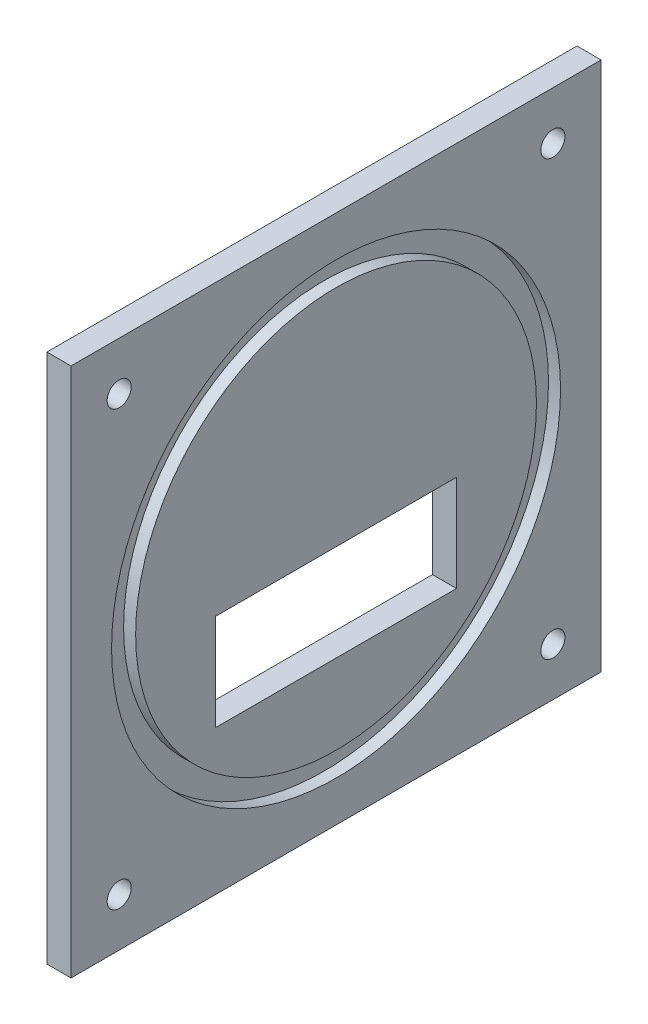
ISO-10303-21;
HEADER;
FILE_DESCRIPTION(('STEP AP214'),'2;1');
FILE_NAME('part.step','',(''),(''),'','','');
FILE_SCHEMA(('AUTOMOTIVE_DESIGN { 1 0 10303 214 1 1 1 1 }'));
ENDSEC;
DATA;
#1=APPLICATION_CONTEXT('core data for automotive mechanical design processes');
#2=APPLICATION_PROTOCOL_DEFINITION('international standard','automotive_design',2000,#1);
#3=PRODUCT_CONTEXT('',#1,'mechanical');
#4=PRODUCT('Part','Part','',(#3));
#5=PRODUCT_RELATED_PRODUCT_CATEGORY('part','',(#4));
#6=PRODUCT_DEFINITION_FORMATION('','',#4);
#7=PRODUCT_DEFINITION_CONTEXT('part definition',#1,'design');
#8=PRODUCT_DEFINITION('design','',#6,#7);
#9=PRODUCT_DEFINITION_SHAPE('','',#8);
#10=(LENGTH_UNIT() NAMED_UNIT(*) SI_UNIT(.MILLI.,.METRE.));
#11=(NAMED_UNIT(*) PLANE_ANGLE_UNIT() SI_UNIT($,.RADIAN.));
#12=(NAMED_UNIT(*) SI_UNIT($,.STERADIAN.) SOLID_ANGLE_UNIT());
#13=UNCERTAINTY_MEASURE_WITH_UNIT(LENGTH_MEASURE(1.E-05),#10,'distance_accuracy_value','');
#14=(GEOMETRIC_REPRESENTATION_CONTEXT(3) GLOBAL_UNCERTAINTY_ASSIGNED_CONTEXT((#13)) GLOBAL_UNIT_ASSIGNED_CONTEXT((#10,
#11,#12)) REPRESENTATION_CONTEXT('',''));
#15=CARTESIAN_POINT('',(0.,0.,0.));
#16=DIRECTION('',(0.,0.,1.));
#17=DIRECTION('',(1.,0.,0.));
#18=AXIS2_PLACEMENT_3D('',#15,#16,#17);
#19=CARTESIAN_POINT('',(10.,0.,0.));
#20=DIRECTION('',(-1.,0.,0.));
#21=DIRECTION('',(0.,0.,1.));
#22=AXIS2_PLACEMENT_3D('',#19,#20,#21);
#23=PLANE('',#22);
#24=DIRECTION('',(0.,-1.,0.));
#25=VECTOR('',#24,1.);
#26=CARTESIAN_POINT('',(10.,100.,-60.));
#27=LINE('',#26,#25);
#28=CARTESIAN_POINT('',(10.,100.,-60.));
#29=VERTEX_POINT('',#28);
#30=CARTESIAN_POINT('',(10.,60.,-60.));
#31=VERTEX_POINT('',#30);
#32=EDGE_CURVE('E97',#29,#31,#27,.T.);
#33=ORIENTED_EDGE('',*,*,#32,.F.);
#34=DIRECTION('',(0.,0.,1.));
#35=VECTOR('',#34,1.);
#36=CARTESIAN_POINT('',(10.,100.,-60.));
#37=LINE('',#36,#35);
#38=CARTESIAN_POINT('',(10.,100.,-160.));
#39=VERTEX_POINT('',#38);
#40=EDGE_CURVE('E120',#39,#29,#37,.T.);
#41=ORIENTED_EDGE('',*,*,#40,.F.);
#42=DIRECTION('',(0.,1.,0.));
#43=VECTOR('',#42,1.);
#44=CARTESIAN_POINT('',(10.,100.,-160.));
#45=LINE('',#44,#43);
#46=CARTESIAN_POINT('',(10.,60.,-160.));
#47=VERTEX_POINT('',#46);
#48=EDGE_CURVE('E118',#47,#39,#45,.T.);
#49=ORIENTED_EDGE('',*,*,#48,.F.);
#50=DIRECTION('',(0.,0.,-1.));
#51=VECTOR('',#50,1.);
#52=CARTESIAN_POINT('',(10.,60.,-60.));
#53=LINE('',#52,#51);
#54=EDGE_CURVE('E105',#31,#47,#53,.T.);
#55=ORIENTED_EDGE('',*,*,#54,.F.);
#56=EDGE_LOOP('',(#33,#41,#49,#55));
#57=FACE_BOUND('',#56,.T.);
#58=CARTESIAN_POINT('',(10.,110.,-110.));
#59=DIRECTION('',(1.,0.,0.));
#60=DIRECTION('',(0.,0.,-1.));
#61=AXIS2_PLACEMENT_3D('',#58,#59,#60);
#62=CIRCLE('',#61,83.17284);
#63=CARTESIAN_POINT('',(10.,110.,-193.17284));
#64=VERTEX_POINT('',#63);
#65=EDGE_CURVE('E271',#64,#64,#62,.T.);
#66=ORIENTED_EDGE('',*,*,#65,.T.);
#67=EDGE_LOOP('',(#66));
#68=FACE_BOUND('',#67,.T.);
#69=ADVANCED_FACE('F32',(#57,#68),#23,.F.);
#70=CARTESIAN_POINT('',(10.,20.,-20.));
#71=DIRECTION('',(1.,0.,0.));
#72=DIRECTION('',(0.,0.,-1.));
#73=AXIS2_PLACEMENT_3D('',#70,#71,#72);
#74=CIRCLE('',#73,5.);
#75=CARTESIAN_POINT('',(10.,20.,-25.));
#76=VERTEX_POINT('',#75);
#77=EDGE_CURVE('E251',#76,#76,#74,.T.);
#78=ORIENTED_EDGE('',*,*,#77,.F.);
#79=EDGE_LOOP('',(#78));
#80=FACE_BOUND('',#79,.T.);
#81=CARTESIAN_POINT('',(10.,20.,-200.));
#82=DIRECTION('',(1.,0.,0.));
#83=DIRECTION('',(0.,0.,-1.));
#84=AXIS2_PLACEMENT_3D('',#81,#82,#83);
#85=CIRCLE('',#84,4.99999999999999);
#86=CARTESIAN_POINT('',(10.,20.,-205.));
#87=VERTEX_POINT('',#86);
#88=EDGE_CURVE('E253',#87,#87,#85,.T.);
#89=ORIENTED_EDGE('',*,*,#88,.F.);
#90=EDGE_LOOP('',(#89));
#91=FACE_BOUND('',#90,.T.);
#92=CARTESIAN_POINT('',(10.,200.,-200.));
#93=DIRECTION('',(1.,0.,0.));
#94=DIRECTION('',(0.,0.,-1.));
#95=AXIS2_PLACEMENT_3D('',#92,#93,#94);
#96=CIRCLE('',#95,4.99999999999999);
#97=CARTESIAN_POINT('',(10.,200.,-205.));
#98=VERTEX_POINT('',#97);
#99=EDGE_CURVE('E259',#98,#98,#96,.T.);
#100=ORIENTED_EDGE('',*,*,#99,.F.);
#101=EDGE_LOOP('',(#100));
#102=FACE_BOUND('',#101,.T.);
#103=CARTESIAN_POINT('',(10.,200.,-20.));
#104=DIRECTION('',(1.,0.,0.));
#105=DIRECTION('',(0.,0.,-1.));
#106=AXIS2_PLACEMENT_3D('',#103,#104,#105);
#107=CIRCLE('',#106,5.00000000000001);
#108=CARTESIAN_POINT('',(10.,200.,-25.));
#109=VERTEX_POINT('',#108);
#110=EDGE_CURVE('E265',#109,#109,#107,.T.);
#111=ORIENTED_EDGE('',*,*,#110,.F.);
#112=EDGE_LOOP('',(#111));
#113=FACE_BOUND('',#112,.T.);
#114=CARTESIAN_POINT('',(10.,110.,-110.));
#115=DIRECTION('',(1.,0.,0.));
#116=DIRECTION('',(0.,0.,-1.));
#117=AXIS2_PLACEMENT_3D('',#114,#115,#116);
#118=CIRCLE('',#117,93.17284);
#119=CARTESIAN_POINT('',(10.,110.,-203.17284));
#120=VERTEX_POINT('',#119);
#121=EDGE_CURVE('E277',#120,#120,#118,.T.);
#122=ORIENTED_EDGE('',*,*,#121,.F.);
#123=EDGE_LOOP('',(#122));
#124=FACE_BOUND('',#123,.T.);
#125=DIRECTION('',(0.,-1.,0.));
#126=VECTOR('',#125,1.);
#127=CARTESIAN_POINT('',(10.,0.,0.));
#128=LINE('',#127,#126);
#129=CARTESIAN_POINT('',(10.,220.,0.));
#130=VERTEX_POINT('',#129);
#131=CARTESIAN_POINT('',(10.,0.,0.));
#132=VERTEX_POINT('',#131);
#133=EDGE_CURVE('E136',#130,#132,#128,.T.);
#134=ORIENTED_EDGE('',*,*,#133,.T.);
#135=DIRECTION('',(0.,0.,-1.));
#136=VECTOR('',#135,1.);
#137=CARTESIAN_POINT('',(10.,0.,0.));
#138=LINE('',#137,#136);
#139=CARTESIAN_POINT('',(10.,0.,-220.));
#140=VERTEX_POINT('',#139);
#141=EDGE_CURVE('E139',#132,#140,#138,.T.);
#142=ORIENTED_EDGE('',*,*,#141,.T.);
#143=DIRECTION('',(0.,1.,0.));
#144=VECTOR('',#143,1.);
#145=CARTESIAN_POINT('',(10.,0.,-220.));
#146=LINE('',#145,#144);
#147=CARTESIAN_POINT('',(10.,220.,-220.));
#148=VERTEX_POINT('',#147);
#149=EDGE_CURVE('E142',#140,#148,#146,.T.);
#150=ORIENTED_EDGE('',*,*,#149,.T.);
#151=DIRECTION('',(0.,0.,1.));
#152=VECTOR('',#151,1.);
#153=CARTESIAN_POINT('',(10.,220.,0.));
#154=LINE('',#153,#152);
#155=EDGE_CURVE('E144',#148,#130,#154,.T.);
#156=ORIENTED_EDGE('',*,*,#155,.T.);
#157=EDGE_LOOP('',(#134,#142,#150,#156));
#158=FACE_BOUND('',#157,.T.);
#159=ADVANCED_FACE('F179',(#80,#91,#102,#113,#124,#158),#23,.F.);
#160=CARTESIAN_POINT('',(0.,0.,0.));
#161=DIRECTION('',(-1.,0.,0.));
#162=DIRECTION('',(0.,0.,1.));
#163=AXIS2_PLACEMENT_3D('',#160,#161,#162);
#164=PLANE('',#163);
#165=CARTESIAN_POINT('',(0.,20.,-20.));
#166=DIRECTION('',(1.,0.,0.));
#167=DIRECTION('',(0.,0.,-1.));
#168=AXIS2_PLACEMENT_3D('',#165,#166,#167);
#169=CIRCLE('',#168,5.);
#170=CARTESIAN_POINT('',(0.,20.,-25.));
#171=VERTEX_POINT('',#170);
#172=EDGE_CURVE('E248',#171,#171,#169,.T.);
#173=ORIENTED_EDGE('',*,*,#172,.T.);
#174=EDGE_LOOP('',(#173));
#175=FACE_BOUND('',#174,.T.);
#176=CARTESIAN_POINT('',(0.,20.,-200.));
#177=DIRECTION('',(1.,0.,0.));
#178=DIRECTION('',(0.,0.,-1.));
#179=AXIS2_PLACEMENT_3D('',#176,#177,#178);
#180=CIRCLE('',#179,4.99999999999999);
#181=CARTESIAN_POINT('',(0.,20.,-205.));
#182=VERTEX_POINT('',#181);
#183=EDGE_CURVE('E256',#182,#182,#180,.T.);
#184=ORIENTED_EDGE('',*,*,#183,.T.);
#185=EDGE_LOOP('',(#184));
#186=FACE_BOUND('',#185,.T.);
#187=CARTESIAN_POINT('',(0.,200.,-200.));
#188=DIRECTION('',(1.,0.,0.));
#189=DIRECTION('',(0.,0.,-1.));
#190=AXIS2_PLACEMENT_3D('',#187,#188,#189);
#191=CIRCLE('',#190,4.99999999999999);
#192=CARTESIAN_POINT('',(0.,200.,-205.));
#193=VERTEX_POINT('',#192);
#194=EDGE_CURVE('E262',#193,#193,#191,.T.);
#195=ORIENTED_EDGE('',*,*,#194,.T.);
#196=EDGE_LOOP('',(#195));
#197=FACE_BOUND('',#196,.T.);
#198=CARTESIAN_POINT('',(0.,200.,-20.));
#199=DIRECTION('',(1.,0.,0.));
#200=DIRECTION('',(0.,0.,-1.));
#201=AXIS2_PLACEMENT_3D('',#198,#199,#200);
#202=CIRCLE('',#201,5.00000000000001);
#203=CARTESIAN_POINT('',(0.,200.,-25.));
#204=VERTEX_POINT('',#203);
#205=EDGE_CURVE('E268',#204,#204,#202,.T.);
#206=ORIENTED_EDGE('',*,*,#205,.T.);
#207=EDGE_LOOP('',(#206));
#208=FACE_BOUND('',#207,.T.);
#209=DIRECTION('',(0.,-1.,0.));
#210=VECTOR('',#209,1.);
#211=CARTESIAN_POINT('',(0.,0.,0.));
#212=LINE('',#211,#210);
#213=CARTESIAN_POINT('',(0.,220.,0.));
#214=VERTEX_POINT('',#213);
#215=CARTESIAN_POINT('',(0.,0.,0.));
#216=VERTEX_POINT('',#215);
#217=EDGE_CURVE('E113',#214,#216,#212,.T.);
#218=ORIENTED_EDGE('',*,*,#217,.F.);
#219=DIRECTION('',(0.,0.,1.));
#220=VECTOR('',#219,1.);
#221=CARTESIAN_POINT('',(0.,220.,0.));
#222=LINE('',#221,#220);
#223=CARTESIAN_POINT('',(0.,220.,-220.));
#224=VERTEX_POINT('',#223);
#225=EDGE_CURVE('E140',#224,#214,#222,.T.);
#226=ORIENTED_EDGE('',*,*,#225,.F.);
#227=DIRECTION('',(0.,1.,0.));
#228=VECTOR('',#227,1.);
#229=CARTESIAN_POINT('',(0.,0.,-220.));
#230=LINE('',#229,#228);
#231=CARTESIAN_POINT('',(0.,0.,-220.));
#232=VERTEX_POINT('',#231);
#233=EDGE_CURVE('E151',#232,#224,#230,.T.);
#234=ORIENTED_EDGE('',*,*,#233,.F.);
#235=DIRECTION('',(0.,0.,-1.));
#236=VECTOR('',#235,1.);
#237=CARTESIAN_POINT('',(0.,0.,0.));
#238=LINE('',#237,#236);
#239=EDGE_CURVE('E149',#216,#232,#238,.T.);
#240=ORIENTED_EDGE('',*,*,#239,.F.);
#241=EDGE_LOOP('',(#218,#226,#234,#240));
#242=FACE_BOUND('',#241,.T.);
#243=DIRECTION('',(0.,0.,1.));
#244=VECTOR('',#243,1.);
#245=CARTESIAN_POINT('',(0.,100.,-60.));
#246=LINE('',#245,#244);
#247=CARTESIAN_POINT('',(0.,100.,-160.));
#248=VERTEX_POINT('',#247);
#249=CARTESIAN_POINT('',(0.,100.,-60.));
#250=VERTEX_POINT('',#249);
#251=EDGE_CURVE('E106',#248,#250,#246,.T.);
#252=ORIENTED_EDGE('',*,*,#251,.T.);
#253=DIRECTION('',(0.,-1.,0.));
#254=VECTOR('',#253,1.);
#255=CARTESIAN_POINT('',(0.,100.,-60.));
#256=LINE('',#255,#254);
#257=CARTESIAN_POINT('',(0.,60.,-60.));
#258=VERTEX_POINT('',#257);
#259=EDGE_CURVE('E55',#250,#258,#256,.T.);
#260=ORIENTED_EDGE('',*,*,#259,.T.);
#261=DIRECTION('',(0.,0.,-1.));
#262=VECTOR('',#261,1.);
#263=CARTESIAN_POINT('',(0.,60.,-60.));
#264=LINE('',#263,#262);
#265=CARTESIAN_POINT('',(0.,60.,-160.));
#266=VERTEX_POINT('',#265);
#267=EDGE_CURVE('E112',#258,#266,#264,.T.);
#268=ORIENTED_EDGE('',*,*,#267,.T.);
#269=DIRECTION('',(0.,1.,0.));
#270=VECTOR('',#269,1.);
#271=CARTESIAN_POINT('',(0.,100.,-160.));
#272=LINE('',#271,#270);
#273=EDGE_CURVE('E128',#266,#248,#272,.T.);
#274=ORIENTED_EDGE('',*,*,#273,.T.);
#275=EDGE_LOOP('',(#252,#260,#268,#274));
#276=FACE_BOUND('',#275,.T.);
#277=ADVANCED_FACE('F169',(#175,#186,#197,#208,#242,#276),#164,.T.);
#278=CARTESIAN_POINT('',(10.,0.,0.));
#279=DIRECTION('',(0.,0.,-1.));
#280=DIRECTION('',(-1.,0.,0.));
#281=AXIS2_PLACEMENT_3D('',#278,#279,#280);
#282=PLANE('',#281);
#283=ORIENTED_EDGE('',*,*,#217,.T.);
#284=DIRECTION('',(-1.,0.,0.));
#285=VECTOR('',#284,1.);
#286=CARTESIAN_POINT('',(10.,0.,0.));
#287=LINE('',#286,#285);
#288=EDGE_CURVE('E11',#132,#216,#287,.T.);
#289=ORIENTED_EDGE('',*,*,#288,.F.);
#290=ORIENTED_EDGE('',*,*,#133,.F.);
#291=DIRECTION('',(-1.,0.,0.));
#292=VECTOR('',#291,1.);
#293=CARTESIAN_POINT('',(10.,220.,0.));
#294=LINE('',#293,#292);
#295=EDGE_CURVE('E146',#130,#214,#294,.T.);
#296=ORIENTED_EDGE('',*,*,#295,.T.);
#297=EDGE_LOOP('',(#283,#289,#290,#296));
#298=FACE_BOUND('',#297,.T.);
#299=ADVANCED_FACE('F34',(#298),#282,.F.);
#300=CARTESIAN_POINT('',(10.,0.,0.));
#301=DIRECTION('',(0.,1.,0.));
#302=DIRECTION('',(0.,0.,1.));
#303=AXIS2_PLACEMENT_3D('',#300,#301,#302);
#304=PLANE('',#303);
#305=ORIENTED_EDGE('',*,*,#239,.T.);
#306=DIRECTION('',(-1.,0.,0.));
#307=VECTOR('',#306,1.);
#308=CARTESIAN_POINT('',(10.,0.,-220.));
#309=LINE('',#308,#307);
#310=EDGE_CURVE('E40',#140,#232,#309,.T.);
#311=ORIENTED_EDGE('',*,*,#310,.F.);
#312=ORIENTED_EDGE('',*,*,#141,.F.);
#313=ORIENTED_EDGE('',*,*,#288,.T.);
#314=EDGE_LOOP('',(#305,#311,#312,#313));
#315=FACE_BOUND('',#314,.T.);
#316=ADVANCED_FACE('F180',(#315),#304,.F.);
#317=CARTESIAN_POINT('',(10.,0.,-220.));
#318=DIRECTION('',(0.,0.,1.));
#319=DIRECTION('',(1.,0.,0.));
#320=AXIS2_PLACEMENT_3D('',#317,#318,#319);
#321=PLANE('',#320);
#322=ORIENTED_EDGE('',*,*,#233,.T.);
#323=DIRECTION('',(-1.,0.,0.));
#324=VECTOR('',#323,1.);
#325=CARTESIAN_POINT('',(10.,220.,-220.));
#326=LINE('',#325,#324);
#327=EDGE_CURVE('E156',#148,#224,#326,.T.);
#328=ORIENTED_EDGE('',*,*,#327,.F.);
#329=ORIENTED_EDGE('',*,*,#149,.F.);
#330=ORIENTED_EDGE('',*,*,#310,.T.);
#331=EDGE_LOOP('',(#322,#328,#329,#330));
#332=FACE_BOUND('',#331,.T.);
#333=ADVANCED_FACE('F163',(#332),#321,.F.);
#334=CARTESIAN_POINT('',(10.,220.,0.));
#335=DIRECTION('',(0.,-1.,0.));
#336=DIRECTION('',(0.,0.,-1.));
#337=AXIS2_PLACEMENT_3D('',#334,#335,#336);
#338=PLANE('',#337);
#339=ORIENTED_EDGE('',*,*,#225,.T.);
#340=ORIENTED_EDGE('',*,*,#295,.F.);
#341=ORIENTED_EDGE('',*,*,#155,.F.);
#342=ORIENTED_EDGE('',*,*,#327,.T.);
#343=EDGE_LOOP('',(#339,#340,#341,#342));
#344=FACE_BOUND('',#343,.T.);
#345=ADVANCED_FACE('F173',(#344),#338,.F.);
#346=CARTESIAN_POINT('',(10.,100.,-60.));
#347=DIRECTION('',(0.,0.,-1.));
#348=DIRECTION('',(0.,1.,0.));
#349=AXIS2_PLACEMENT_3D('',#346,#347,#348);
#350=PLANE('',#349);
#351=ORIENTED_EDGE('',*,*,#259,.F.);
#352=DIRECTION('',(-1.,0.,0.));
#353=VECTOR('',#352,1.);
#354=CARTESIAN_POINT('',(10.,100.,-60.));
#355=LINE('',#354,#353);
#356=EDGE_CURVE('E101',#29,#250,#355,.T.);
#357=ORIENTED_EDGE('',*,*,#356,.F.);
#358=ORIENTED_EDGE('',*,*,#32,.T.);
#359=DIRECTION('',(-1.,0.,0.));
#360=VECTOR('',#359,1.);
#361=CARTESIAN_POINT('',(10.,60.,-60.));
#362=LINE('',#361,#360);
#363=EDGE_CURVE('E100',#31,#258,#362,.T.);
#364=ORIENTED_EDGE('',*,*,#363,.T.);
#365=EDGE_LOOP('',(#351,#357,#358,#364));
#366=FACE_BOUND('',#365,.T.);
#367=ADVANCED_FACE('F99',(#366),#350,.T.);
#368=CARTESIAN_POINT('',(10.,60.,-60.));
#369=DIRECTION('',(0.,1.,0.));
#370=DIRECTION('',(0.,0.,1.));
#371=AXIS2_PLACEMENT_3D('',#368,#369,#370);
#372=PLANE('',#371);
#373=ORIENTED_EDGE('',*,*,#267,.F.);
#374=ORIENTED_EDGE('',*,*,#363,.F.);
#375=ORIENTED_EDGE('',*,*,#54,.T.);
#376=DIRECTION('',(-1.,0.,0.));
#377=VECTOR('',#376,1.);
#378=CARTESIAN_POINT('',(10.,60.,-160.));
#379=LINE('',#378,#377);
#380=EDGE_CURVE('E114',#47,#266,#379,.T.);
#381=ORIENTED_EDGE('',*,*,#380,.T.);
#382=EDGE_LOOP('',(#373,#374,#375,#381));
#383=FACE_BOUND('',#382,.T.);
#384=ADVANCED_FACE('F109',(#383),#372,.T.);
#385=CARTESIAN_POINT('',(10.,100.,-160.));
#386=DIRECTION('',(0.,0.,1.));
#387=DIRECTION('',(0.,-1.,0.));
#388=AXIS2_PLACEMENT_3D('',#385,#386,#387);
#389=PLANE('',#388);
#390=ORIENTED_EDGE('',*,*,#273,.F.);
#391=ORIENTED_EDGE('',*,*,#380,.F.);
#392=ORIENTED_EDGE('',*,*,#48,.T.);
#393=DIRECTION('',(-1.,0.,0.));
#394=VECTOR('',#393,1.);
#395=CARTESIAN_POINT('',(10.,100.,-160.));
#396=LINE('',#395,#394);
#397=EDGE_CURVE('E47',#39,#248,#396,.T.);
#398=ORIENTED_EDGE('',*,*,#397,.T.);
#399=EDGE_LOOP('',(#390,#391,#392,#398));
#400=FACE_BOUND('',#399,.T.);
#401=ADVANCED_FACE('F206',(#400),#389,.T.);
#402=CARTESIAN_POINT('',(10.,100.,-60.));
#403=DIRECTION('',(0.,-1.,0.));
#404=DIRECTION('',(0.,0.,-1.));
#405=AXIS2_PLACEMENT_3D('',#402,#403,#404);
#406=PLANE('',#405);
#407=ORIENTED_EDGE('',*,*,#251,.F.);
#408=ORIENTED_EDGE('',*,*,#397,.F.);
#409=ORIENTED_EDGE('',*,*,#40,.T.);
#410=ORIENTED_EDGE('',*,*,#356,.T.);
#411=EDGE_LOOP('',(#407,#408,#409,#410));
#412=FACE_BOUND('',#411,.T.);
#413=ADVANCED_FACE('F210',(#412),#406,.T.);
#414=CARTESIAN_POINT('',(5.,110.,-110.));
#415=DIRECTION('',(1.,0.,0.));
#416=DIRECTION('',(0.,0.,-1.));
#417=AXIS2_PLACEMENT_3D('',#414,#415,#416);
#418=CYLINDRICAL_SURFACE('',#417,93.17284);
#419=CARTESIAN_POINT('',(5.,110.,-110.));
#420=DIRECTION('',(1.,0.,0.));
#421=DIRECTION('',(0.,0.,-1.));
#422=AXIS2_PLACEMENT_3D('',#419,#420,#421);
#423=CIRCLE('',#422,93.17284);
#424=CARTESIAN_POINT('',(5.,110.,-203.17284));
#425=VERTEX_POINT('',#424);
#426=EDGE_CURVE('E126',#425,#425,#423,.T.);
#427=ORIENTED_EDGE('',*,*,#426,.F.);
#428=EDGE_LOOP('',(#427));
#429=FACE_BOUND('',#428,.T.);
#430=ORIENTED_EDGE('',*,*,#121,.T.);
#431=EDGE_LOOP('',(#430));
#432=FACE_BOUND('',#431,.T.);
#433=ADVANCED_FACE('F216',(#429,#432),#418,.F.);
#434=CARTESIAN_POINT('',(5.,110.,-110.));
#435=DIRECTION('',(1.,0.,0.));
#436=DIRECTION('',(0.,0.,-1.));
#437=AXIS2_PLACEMENT_3D('',#434,#435,#436);
#438=PLANE('',#437);
#439=CARTESIAN_POINT('',(5.,110.,-110.));
#440=DIRECTION('',(1.,0.,0.));
#441=DIRECTION('',(0.,0.,-1.));
#442=AXIS2_PLACEMENT_3D('',#439,#440,#441);
#443=CIRCLE('',#442,83.17284);
#444=CARTESIAN_POINT('',(5.,110.,-193.17284));
#445=VERTEX_POINT('',#444);
#446=EDGE_CURVE('E274',#445,#445,#443,.T.);
#447=ORIENTED_EDGE('',*,*,#446,.F.);
#448=EDGE_LOOP('',(#447));
#449=FACE_BOUND('',#448,.T.);
#450=ORIENTED_EDGE('',*,*,#426,.T.);
#451=EDGE_LOOP('',(#450));
#452=FACE_BOUND('',#451,.T.);
#453=ADVANCED_FACE('F219',(#449,#452),#438,.T.);
#454=CARTESIAN_POINT('',(5.,110.,-110.));
#455=DIRECTION('',(1.,0.,0.));
#456=DIRECTION('',(0.,0.,-1.));
#457=AXIS2_PLACEMENT_3D('',#454,#455,#456);
#458=CYLINDRICAL_SURFACE('',#457,83.17284);
#459=ORIENTED_EDGE('',*,*,#446,.T.);
#460=EDGE_LOOP('',(#459));
#461=FACE_BOUND('',#460,.T.);
#462=ORIENTED_EDGE('',*,*,#65,.F.);
#463=EDGE_LOOP('',(#462));
#464=FACE_BOUND('',#463,.T.);
#465=ADVANCED_FACE('F223',(#461,#464),#458,.T.);
#466=CARTESIAN_POINT('',(0.,200.,-20.));
#467=DIRECTION('',(1.,0.,0.));
#468=DIRECTION('',(0.,0.,-1.));
#469=AXIS2_PLACEMENT_3D('',#466,#467,#468);
#470=CYLINDRICAL_SURFACE('',#469,5.00000000000001);
#471=ORIENTED_EDGE('',*,*,#205,.F.);
#472=EDGE_LOOP('',(#471));
#473=FACE_BOUND('',#472,.T.);
#474=ORIENTED_EDGE('',*,*,#110,.T.);
#475=EDGE_LOOP('',(#474));
#476=FACE_BOUND('',#475,.T.);
#477=ADVANCED_FACE('F227',(#473,#476),#470,.F.);
#478=CARTESIAN_POINT('',(0.,200.,-200.));
#479=DIRECTION('',(1.,0.,0.));
#480=DIRECTION('',(0.,0.,-1.));
#481=AXIS2_PLACEMENT_3D('',#478,#479,#480);
#482=CYLINDRICAL_SURFACE('',#481,4.99999999999999);
#483=ORIENTED_EDGE('',*,*,#194,.F.);
#484=EDGE_LOOP('',(#483));
#485=FACE_BOUND('',#484,.T.);
#486=ORIENTED_EDGE('',*,*,#99,.T.);
#487=EDGE_LOOP('',(#486));
#488=FACE_BOUND('',#487,.T.);
#489=ADVANCED_FACE('F231',(#485,#488),#482,.F.);
#490=CARTESIAN_POINT('',(0.,20.,-200.));
#491=DIRECTION('',(1.,0.,0.));
#492=DIRECTION('',(0.,0.,-1.));
#493=AXIS2_PLACEMENT_3D('',#490,#491,#492);
#494=CYLINDRICAL_SURFACE('',#493,4.99999999999999);
#495=ORIENTED_EDGE('',*,*,#183,.F.);
#496=EDGE_LOOP('',(#495));
#497=FACE_BOUND('',#496,.T.);
#498=ORIENTED_EDGE('',*,*,#88,.T.);
#499=EDGE_LOOP('',(#498));
#500=FACE_BOUND('',#499,.T.);
#501=ADVANCED_FACE('F235',(#497,#500),#494,.F.);
#502=CARTESIAN_POINT('',(0.,20.,-20.));
#503=DIRECTION('',(1.,0.,0.));
#504=DIRECTION('',(0.,0.,-1.));
#505=AXIS2_PLACEMENT_3D('',#502,#503,#504);
#506=CYLINDRICAL_SURFACE('',#505,5.);
#507=ORIENTED_EDGE('',*,*,#172,.F.);
#508=EDGE_LOOP('',(#507));
#509=FACE_BOUND('',#508,.T.);
#510=ORIENTED_EDGE('',*,*,#77,.T.);
#511=EDGE_LOOP('',(#510));
#512=FACE_BOUND('',#511,.T.);
#513=ADVANCED_FACE('F239',(#509,#512),#506,.F.);
#514=CLOSED_SHELL('',(#69,#159,#277,#299,#316,#333,#345,#367,#384,#401,#413,#433,#453,#465,#477,
#489,#501,#513));
#515=MANIFOLD_SOLID_BREP('B2',#514);
#516=ADVANCED_BREP_SHAPE_REPRESENTATION('',(#18,#515),#14);
#517=SHAPE_DEFINITION_REPRESENTATION(#9,#516);
ENDSEC;
END-ISO-10303-21;
